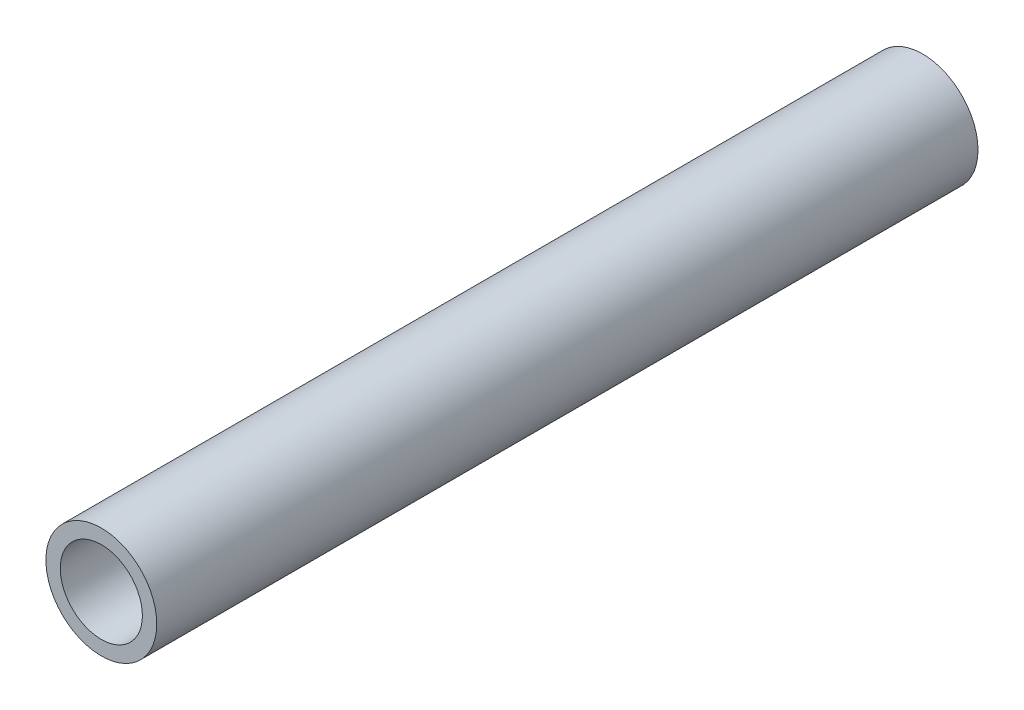
ISO-10303-21;
HEADER;
FILE_DESCRIPTION(('STEP AP214'),'2;1');
FILE_NAME('part.step','',(''),(''),'','','');
FILE_SCHEMA(('AUTOMOTIVE_DESIGN { 1 0 10303 214 1 1 1 1 }'));
ENDSEC;
DATA;
#1=APPLICATION_CONTEXT('core data for automotive mechanical design processes');
#2=APPLICATION_PROTOCOL_DEFINITION('international standard','automotive_design',2000,#1);
#3=PRODUCT_CONTEXT('',#1,'mechanical');
#4=PRODUCT('Part','Part','',(#3));
#5=PRODUCT_RELATED_PRODUCT_CATEGORY('part','',(#4));
#6=PRODUCT_DEFINITION_FORMATION('','',#4);
#7=PRODUCT_DEFINITION_CONTEXT('part definition',#1,'design');
#8=PRODUCT_DEFINITION('design','',#6,#7);
#9=PRODUCT_DEFINITION_SHAPE('','',#8);
#10=(LENGTH_UNIT() NAMED_UNIT(*) SI_UNIT(.MILLI.,.METRE.));
#11=(NAMED_UNIT(*) PLANE_ANGLE_UNIT() SI_UNIT($,.RADIAN.));
#12=(NAMED_UNIT(*) SI_UNIT($,.STERADIAN.) SOLID_ANGLE_UNIT());
#13=UNCERTAINTY_MEASURE_WITH_UNIT(LENGTH_MEASURE(1.E-05),#10,'distance_accuracy_value','');
#14=(GEOMETRIC_REPRESENTATION_CONTEXT(3) GLOBAL_UNCERTAINTY_ASSIGNED_CONTEXT((#13)) GLOBAL_UNIT_ASSIGNED_CONTEXT((#10,
#11,#12)) REPRESENTATION_CONTEXT('',''));
#15=CARTESIAN_POINT('',(0.,0.,0.));
#16=DIRECTION('',(0.,0.,1.));
#17=DIRECTION('',(1.,0.,0.));
#18=AXIS2_PLACEMENT_3D('',#15,#16,#17);
#19=CARTESIAN_POINT('',(0.,0.,20.));
#20=DIRECTION('',(0.,0.,1.));
#21=DIRECTION('',(1.,0.,0.));
#22=AXIS2_PLACEMENT_3D('',#19,#20,#21);
#23=PLANE('',#22);
#24=CARTESIAN_POINT('',(0.,0.,20.));
#25=DIRECTION('',(0.,0.,1.));
#26=DIRECTION('',(1.,0.,0.));
#27=AXIS2_PLACEMENT_3D('',#24,#25,#26);
#28=CIRCLE('',#27,1.35);
#29=CARTESIAN_POINT('',(1.35,0.,20.));
#30=VERTEX_POINT('',#29);
#31=EDGE_CURVE('E10',#30,#30,#28,.T.);
#32=ORIENTED_EDGE('',*,*,#31,.T.);
#33=EDGE_LOOP('',(#32));
#34=FACE_BOUND('',#33,.T.);
#35=CARTESIAN_POINT('',(0.,0.,20.));
#36=DIRECTION('',(0.,0.,1.));
#37=DIRECTION('',(1.,0.,0.));
#38=AXIS2_PLACEMENT_3D('',#35,#36,#37);
#39=CIRCLE('',#38,1.);
#40=CARTESIAN_POINT('',(1.,0.,20.));
#41=VERTEX_POINT('',#40);
#42=EDGE_CURVE('E41',#41,#41,#39,.T.);
#43=ORIENTED_EDGE('',*,*,#42,.F.);
#44=EDGE_LOOP('',(#43));
#45=FACE_BOUND('',#44,.T.);
#46=ADVANCED_FACE('F30',(#34,#45),#23,.T.);
#47=CARTESIAN_POINT('',(0.,0.,0.));
#48=DIRECTION('',(0.,0.,1.));
#49=DIRECTION('',(1.,0.,0.));
#50=AXIS2_PLACEMENT_3D('',#47,#48,#49);
#51=PLANE('',#50);
#52=CARTESIAN_POINT('',(0.,0.,0.));
#53=DIRECTION('',(0.,0.,1.));
#54=DIRECTION('',(1.,0.,0.));
#55=AXIS2_PLACEMENT_3D('',#52,#53,#54);
#56=CIRCLE('',#55,1.35);
#57=CARTESIAN_POINT('',(1.35,0.,0.));
#58=VERTEX_POINT('',#57);
#59=EDGE_CURVE('E34',#58,#58,#56,.T.);
#60=ORIENTED_EDGE('',*,*,#59,.F.);
#61=EDGE_LOOP('',(#60));
#62=FACE_BOUND('',#61,.T.);
#63=CARTESIAN_POINT('',(0.,0.,0.));
#64=DIRECTION('',(0.,0.,1.));
#65=DIRECTION('',(1.,0.,0.));
#66=AXIS2_PLACEMENT_3D('',#63,#64,#65);
#67=CIRCLE('',#66,1.);
#68=CARTESIAN_POINT('',(1.,0.,0.));
#69=VERTEX_POINT('',#68);
#70=EDGE_CURVE('E43',#69,#69,#67,.T.);
#71=ORIENTED_EDGE('',*,*,#70,.T.);
#72=EDGE_LOOP('',(#71));
#73=FACE_BOUND('',#72,.T.);
#74=ADVANCED_FACE('F53',(#62,#73),#51,.F.);
#75=CARTESIAN_POINT('',(0.,0.,20.));
#76=DIRECTION('',(0.,0.,-1.));
#77=DIRECTION('',(-1.,0.,0.));
#78=AXIS2_PLACEMENT_3D('',#75,#76,#77);
#79=CYLINDRICAL_SURFACE('',#78,1.35);
#80=ORIENTED_EDGE('',*,*,#31,.F.);
#81=EDGE_LOOP('',(#80));
#82=FACE_BOUND('',#81,.T.);
#83=ORIENTED_EDGE('',*,*,#59,.T.);
#84=EDGE_LOOP('',(#83));
#85=FACE_BOUND('',#84,.T.);
#86=ADVANCED_FACE('F32',(#82,#85),#79,.T.);
#87=CARTESIAN_POINT('',(0.,0.,20.));
#88=DIRECTION('',(0.,0.,-1.));
#89=DIRECTION('',(-1.,0.,0.));
#90=AXIS2_PLACEMENT_3D('',#87,#88,#89);
#91=CYLINDRICAL_SURFACE('',#90,1.);
#92=ORIENTED_EDGE('',*,*,#42,.T.);
#93=EDGE_LOOP('',(#92));
#94=FACE_BOUND('',#93,.T.);
#95=ORIENTED_EDGE('',*,*,#70,.F.);
#96=EDGE_LOOP('',(#95));
#97=FACE_BOUND('',#96,.T.);
#98=ADVANCED_FACE('F49',(#94,#97),#91,.F.);
#99=CLOSED_SHELL('',(#46,#74,#86,#98));
#100=MANIFOLD_SOLID_BREP('B2',#99);
#101=ADVANCED_BREP_SHAPE_REPRESENTATION('',(#18,#100),#14);
#102=SHAPE_DEFINITION_REPRESENTATION(#9,#101);
ENDSEC;
END-ISO-10303-21;
